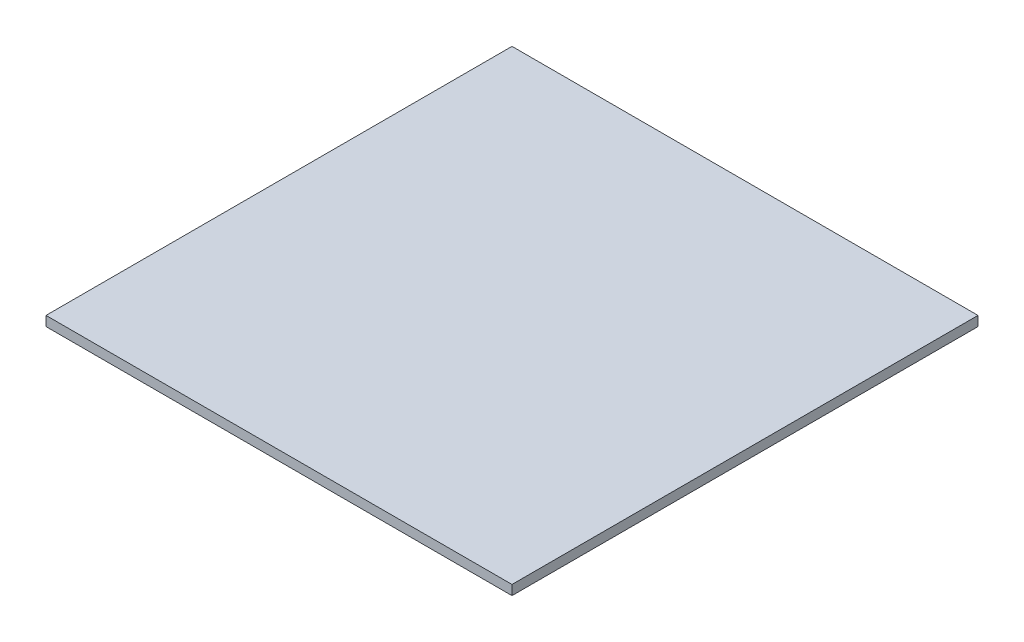
ISO-10303-21;
HEADER;
FILE_DESCRIPTION(('STEP AP214'),'2;1');
FILE_NAME('part.step','',(''),(''),'','','');
FILE_SCHEMA(('AUTOMOTIVE_DESIGN { 1 0 10303 214 1 1 1 1 }'));
ENDSEC;
DATA;
#1=APPLICATION_CONTEXT('core data for automotive mechanical design processes');
#2=APPLICATION_PROTOCOL_DEFINITION('international standard','automotive_design',2000,#1);
#3=PRODUCT_CONTEXT('',#1,'mechanical');
#4=PRODUCT('Part','Part','',(#3));
#5=PRODUCT_RELATED_PRODUCT_CATEGORY('part','',(#4));
#6=PRODUCT_DEFINITION_FORMATION('','',#4);
#7=PRODUCT_DEFINITION_CONTEXT('part definition',#1,'design');
#8=PRODUCT_DEFINITION('design','',#6,#7);
#9=PRODUCT_DEFINITION_SHAPE('','',#8);
#10=(LENGTH_UNIT() NAMED_UNIT(*) SI_UNIT(.MILLI.,.METRE.));
#11=(NAMED_UNIT(*) PLANE_ANGLE_UNIT() SI_UNIT($,.RADIAN.));
#12=(NAMED_UNIT(*) SI_UNIT($,.STERADIAN.) SOLID_ANGLE_UNIT());
#13=UNCERTAINTY_MEASURE_WITH_UNIT(LENGTH_MEASURE(1.E-05),#10,'distance_accuracy_value','');
#14=(GEOMETRIC_REPRESENTATION_CONTEXT(3) GLOBAL_UNCERTAINTY_ASSIGNED_CONTEXT((#13)) GLOBAL_UNIT_ASSIGNED_CONTEXT((#10,
#11,#12)) REPRESENTATION_CONTEXT('',''));
#15=CARTESIAN_POINT('',(0.,0.,0.));
#16=DIRECTION('',(0.,0.,1.));
#17=DIRECTION('',(1.,0.,0.));
#18=AXIS2_PLACEMENT_3D('',#15,#16,#17);
#19=CARTESIAN_POINT('',(304.8,12.7,304.8));
#20=DIRECTION('',(-1.,0.,0.));
#21=DIRECTION('',(0.,0.,1.));
#22=AXIS2_PLACEMENT_3D('',#19,#20,#21);
#23=PLANE('',#22);
#24=DIRECTION('',(0.,0.,-1.));
#25=VECTOR('',#24,1.);
#26=CARTESIAN_POINT('',(304.8,0.,304.8));
#27=LINE('',#26,#25);
#28=CARTESIAN_POINT('',(304.8,0.,304.8));
#29=VERTEX_POINT('',#28);
#30=CARTESIAN_POINT('',(304.8,0.,-304.8));
#31=VERTEX_POINT('',#30);
#32=EDGE_CURVE('E96',#29,#31,#27,.T.);
#33=ORIENTED_EDGE('',*,*,#32,.T.);
#34=DIRECTION('',(0.,-1.,0.));
#35=VECTOR('',#34,1.);
#36=CARTESIAN_POINT('',(304.8,12.7,-304.8));
#37=LINE('',#36,#35);
#38=CARTESIAN_POINT('',(304.8,12.7,-304.8));
#39=VERTEX_POINT('',#38);
#40=EDGE_CURVE('E11',#39,#31,#37,.T.);
#41=ORIENTED_EDGE('',*,*,#40,.F.);
#42=DIRECTION('',(0.,0.,-1.));
#43=VECTOR('',#42,1.);
#44=CARTESIAN_POINT('',(304.8,12.7,304.8));
#45=LINE('',#44,#43);
#46=CARTESIAN_POINT('',(304.8,12.7,304.8));
#47=VERTEX_POINT('',#46);
#48=EDGE_CURVE('E84',#47,#39,#45,.T.);
#49=ORIENTED_EDGE('',*,*,#48,.F.);
#50=DIRECTION('',(0.,-1.,0.));
#51=VECTOR('',#50,1.);
#52=CARTESIAN_POINT('',(304.8,12.7,304.8));
#53=LINE('',#52,#51);
#54=EDGE_CURVE('E92',#47,#29,#53,.T.);
#55=ORIENTED_EDGE('',*,*,#54,.T.);
#56=EDGE_LOOP('',(#33,#41,#49,#55));
#57=FACE_BOUND('',#56,.T.);
#58=ADVANCED_FACE('F33',(#57),#23,.F.);
#59=CARTESIAN_POINT('',(-304.8,12.7,-304.8));
#60=DIRECTION('',(0.,0.,1.));
#61=DIRECTION('',(1.,0.,0.));
#62=AXIS2_PLACEMENT_3D('',#59,#60,#61);
#63=PLANE('',#62);
#64=DIRECTION('',(-1.,0.,0.));
#65=VECTOR('',#64,1.);
#66=CARTESIAN_POINT('',(-304.8,0.,-304.8));
#67=LINE('',#66,#65);
#68=CARTESIAN_POINT('',(-304.8,0.,-304.8));
#69=VERTEX_POINT('',#68);
#70=EDGE_CURVE('E88',#31,#69,#67,.T.);
#71=ORIENTED_EDGE('',*,*,#70,.T.);
#72=DIRECTION('',(0.,-1.,0.));
#73=VECTOR('',#72,1.);
#74=CARTESIAN_POINT('',(-304.8,12.7,-304.8));
#75=LINE('',#74,#73);
#76=CARTESIAN_POINT('',(-304.8,12.7,-304.8));
#77=VERTEX_POINT('',#76);
#78=EDGE_CURVE('E41',#77,#69,#75,.T.);
#79=ORIENTED_EDGE('',*,*,#78,.F.);
#80=DIRECTION('',(-1.,0.,0.));
#81=VECTOR('',#80,1.);
#82=CARTESIAN_POINT('',(-304.8,12.7,-304.8));
#83=LINE('',#82,#81);
#84=EDGE_CURVE('E79',#39,#77,#83,.T.);
#85=ORIENTED_EDGE('',*,*,#84,.F.);
#86=ORIENTED_EDGE('',*,*,#40,.T.);
#87=EDGE_LOOP('',(#71,#79,#85,#86));
#88=FACE_BOUND('',#87,.T.);
#89=ADVANCED_FACE('F87',(#88),#63,.F.);
#90=CARTESIAN_POINT('',(-304.8,12.7,304.8));
#91=DIRECTION('',(1.,0.,0.));
#92=DIRECTION('',(0.,0.,-1.));
#93=AXIS2_PLACEMENT_3D('',#90,#91,#92);
#94=PLANE('',#93);
#95=DIRECTION('',(0.,0.,1.));
#96=VECTOR('',#95,1.);
#97=CARTESIAN_POINT('',(-304.8,0.,304.8));
#98=LINE('',#97,#96);
#99=CARTESIAN_POINT('',(-304.8,0.,304.8));
#100=VERTEX_POINT('',#99);
#101=EDGE_CURVE('E66',#69,#100,#98,.T.);
#102=ORIENTED_EDGE('',*,*,#101,.T.);
#103=DIRECTION('',(0.,-1.,0.));
#104=VECTOR('',#103,1.);
#105=CARTESIAN_POINT('',(-304.8,12.7,304.8));
#106=LINE('',#105,#104);
#107=CARTESIAN_POINT('',(-304.8,12.7,304.8));
#108=VERTEX_POINT('',#107);
#109=EDGE_CURVE('E89',#108,#100,#106,.T.);
#110=ORIENTED_EDGE('',*,*,#109,.F.);
#111=DIRECTION('',(0.,0.,1.));
#112=VECTOR('',#111,1.);
#113=CARTESIAN_POINT('',(-304.8,12.7,304.8));
#114=LINE('',#113,#112);
#115=EDGE_CURVE('E82',#77,#108,#114,.T.);
#116=ORIENTED_EDGE('',*,*,#115,.F.);
#117=ORIENTED_EDGE('',*,*,#78,.T.);
#118=EDGE_LOOP('',(#102,#110,#116,#117));
#119=FACE_BOUND('',#118,.T.);
#120=ADVANCED_FACE('F90',(#119),#94,.F.);
#121=CARTESIAN_POINT('',(-304.8,12.7,304.8));
#122=DIRECTION('',(0.,0.,-1.));
#123=DIRECTION('',(-1.,0.,0.));
#124=AXIS2_PLACEMENT_3D('',#121,#122,#123);
#125=PLANE('',#124);
#126=DIRECTION('',(1.,0.,0.));
#127=VECTOR('',#126,1.);
#128=CARTESIAN_POINT('',(-304.8,0.,304.8));
#129=LINE('',#128,#127);
#130=EDGE_CURVE('E72',#100,#29,#129,.T.);
#131=ORIENTED_EDGE('',*,*,#130,.T.);
#132=ORIENTED_EDGE('',*,*,#54,.F.);
#133=DIRECTION('',(1.,0.,0.));
#134=VECTOR('',#133,1.);
#135=CARTESIAN_POINT('',(-304.8,12.7,304.8));
#136=LINE('',#135,#134);
#137=EDGE_CURVE('E49',#108,#47,#136,.T.);
#138=ORIENTED_EDGE('',*,*,#137,.F.);
#139=ORIENTED_EDGE('',*,*,#109,.T.);
#140=EDGE_LOOP('',(#131,#132,#138,#139));
#141=FACE_BOUND('',#140,.T.);
#142=ADVANCED_FACE('F103',(#141),#125,.F.);
#143=CARTESIAN_POINT('',(0.,12.7,0.));
#144=DIRECTION('',(0.,-1.,0.));
#145=DIRECTION('',(0.,0.,-1.));
#146=AXIS2_PLACEMENT_3D('',#143,#144,#145);
#147=PLANE('',#146);
#148=ORIENTED_EDGE('',*,*,#48,.T.);
#149=ORIENTED_EDGE('',*,*,#84,.T.);
#150=ORIENTED_EDGE('',*,*,#115,.T.);
#151=ORIENTED_EDGE('',*,*,#137,.T.);
#152=EDGE_LOOP('',(#148,#149,#150,#151));
#153=FACE_BOUND('',#152,.T.);
#154=ADVANCED_FACE('F80',(#153),#147,.F.);
#155=CARTESIAN_POINT('',(0.,0.,0.));
#156=DIRECTION('',(0.,-1.,0.));
#157=DIRECTION('',(0.,0.,-1.));
#158=AXIS2_PLACEMENT_3D('',#155,#156,#157);
#159=PLANE('',#158);
#160=ORIENTED_EDGE('',*,*,#32,.F.);
#161=ORIENTED_EDGE('',*,*,#130,.F.);
#162=ORIENTED_EDGE('',*,*,#101,.F.);
#163=ORIENTED_EDGE('',*,*,#70,.F.);
#164=EDGE_LOOP('',(#160,#161,#162,#163));
#165=FACE_BOUND('',#164,.T.);
#166=ADVANCED_FACE('F106',(#165),#159,.T.);
#167=CLOSED_SHELL('',(#58,#89,#120,#142,#154,#166));
#168=MANIFOLD_SOLID_BREP('B2',#167);
#169=ADVANCED_BREP_SHAPE_REPRESENTATION('',(#18,#168),#14);
#170=SHAPE_DEFINITION_REPRESENTATION(#9,#169);
ENDSEC;
END-ISO-10303-21;
